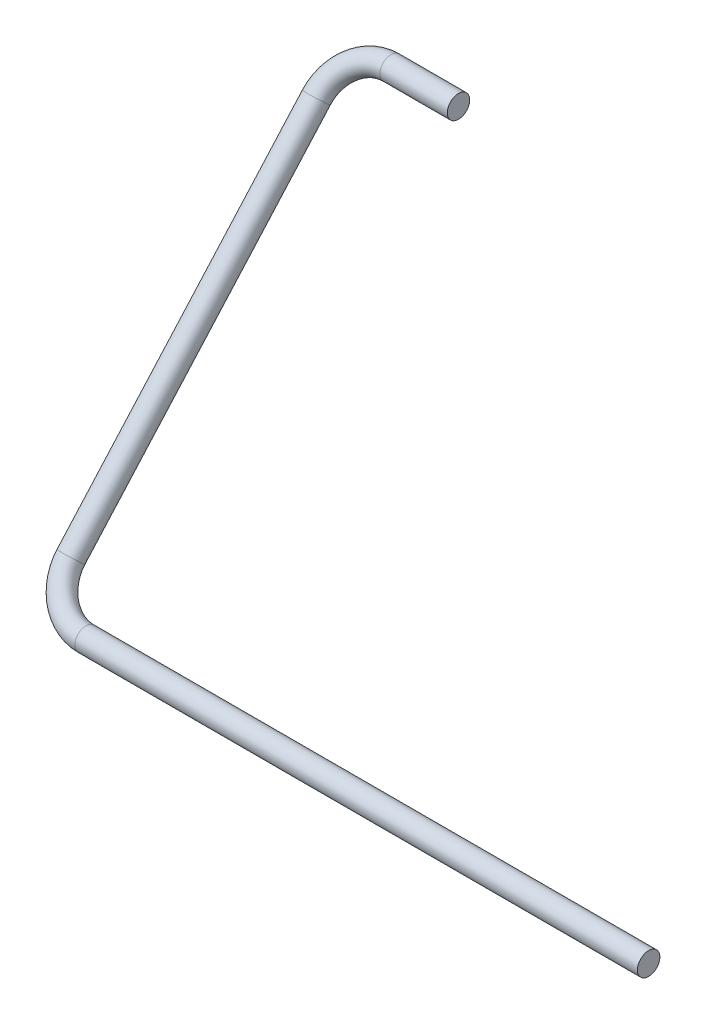
ISO-10303-21;
HEADER;
FILE_DESCRIPTION(('STEP AP214'),'2;1');
FILE_NAME('part.step','',(''),(''),'','','');
FILE_SCHEMA(('AUTOMOTIVE_DESIGN { 1 0 10303 214 1 1 1 1 }'));
ENDSEC;
DATA;
#1=APPLICATION_CONTEXT('core data for automotive mechanical design processes');
#2=APPLICATION_PROTOCOL_DEFINITION('international standard','automotive_design',2000,#1);
#3=PRODUCT_CONTEXT('',#1,'mechanical');
#4=PRODUCT('Part','Part','',(#3));
#5=PRODUCT_RELATED_PRODUCT_CATEGORY('part','',(#4));
#6=PRODUCT_DEFINITION_FORMATION('','',#4);
#7=PRODUCT_DEFINITION_CONTEXT('part definition',#1,'design');
#8=PRODUCT_DEFINITION('design','',#6,#7);
#9=PRODUCT_DEFINITION_SHAPE('','',#8);
#10=(LENGTH_UNIT() NAMED_UNIT(*) SI_UNIT(.MILLI.,.METRE.));
#11=(NAMED_UNIT(*) PLANE_ANGLE_UNIT() SI_UNIT($,.RADIAN.));
#12=(NAMED_UNIT(*) SI_UNIT($,.STERADIAN.) SOLID_ANGLE_UNIT());
#13=UNCERTAINTY_MEASURE_WITH_UNIT(LENGTH_MEASURE(1.E-05),#10,'distance_accuracy_value','');
#14=(GEOMETRIC_REPRESENTATION_CONTEXT(3) GLOBAL_UNCERTAINTY_ASSIGNED_CONTEXT((#13)) GLOBAL_UNIT_ASSIGNED_CONTEXT((#10,
#11,#12)) REPRESENTATION_CONTEXT('',''));
#15=CARTESIAN_POINT('',(0.,0.,0.));
#16=DIRECTION('',(0.,0.,1.));
#17=DIRECTION('',(1.,0.,0.));
#18=AXIS2_PLACEMENT_3D('',#15,#16,#17);
#19=CARTESIAN_POINT('',(-354.878454363053,1611.503,66.2784042889684));
#20=DIRECTION('',(-1.,0.,0.));
#21=DIRECTION('',(0.,0.,1.));
#22=AXIS2_PLACEMENT_3D('',#19,#20,#21);
#23=PLANE('',#22);
#24=CARTESIAN_POINT('',(-354.878454363053,1611.503,66.2784042889684));
#25=DIRECTION('',(-1.,0.,0.));
#26=DIRECTION('',(0.,0.,1.));
#27=AXIS2_PLACEMENT_3D('',#24,#25,#26);
#28=CIRCLE('',#27,6.34999999999999);
#29=CARTESIAN_POINT('',(-354.878454363053,1611.503,72.6284042889684));
#30=VERTEX_POINT('',#29);
#31=EDGE_CURVE('E79',#30,#30,#28,.T.);
#32=ORIENTED_EDGE('',*,*,#31,.F.);
#33=EDGE_LOOP('',(#32));
#34=FACE_BOUND('',#33,.T.);
#35=ADVANCED_FACE('F57',(#34),#23,.F.);
#36=CARTESIAN_POINT('',(-635.040454363053,1805.03259931892,-106.30682117625));
#37=DIRECTION('',(1.,0.,0.));
#38=DIRECTION('',(0.,0.993476042040195,0.114041018463306));
#39=AXIS2_PLACEMENT_3D('',#36,#37,#38);
#40=PLANE('',#39);
#41=CARTESIAN_POINT('',(-635.040454363053,1805.03259931892,-106.30682117625));
#42=DIRECTION('',(1.,0.,0.));
#43=DIRECTION('',(0.,0.993476042040195,0.114041018463306));
#44=AXIS2_PLACEMENT_3D('',#41,#42,#43);
#45=CIRCLE('',#44,6.34999999999999);
#46=CARTESIAN_POINT('',(-635.040454363053,1811.34117218588,-105.582660709008));
#47=VERTEX_POINT('',#46);
#48=EDGE_CURVE('E13',#47,#47,#45,.T.);
#49=ORIENTED_EDGE('',*,*,#48,.T.);
#50=EDGE_LOOP('',(#49));
#51=FACE_BOUND('',#50,.T.);
#52=ADVANCED_FACE('F86',(#51),#40,.T.);
#53=CARTESIAN_POINT('',(-354.878454363053,1611.503,66.2784042889684));
#54=DIRECTION('',(-1.,0.,0.));
#55=DIRECTION('',(0.,0.,1.));
#56=AXIS2_PLACEMENT_3D('',#53,#54,#55);
#57=CYLINDRICAL_SURFACE('',#56,6.34999999999999);
#58=CARTESIAN_POINT('',(-673.140454363053,1611.503,66.2784042889682));
#59=DIRECTION('',(-1.,0.,0.));
#60=DIRECTION('',(0.,0.,1.));
#61=AXIS2_PLACEMENT_3D('',#58,#59,#60);
#62=CIRCLE('',#61,6.34999999999999);
#63=CARTESIAN_POINT('',(-673.140454363053,1606.76375327889,70.5047550217525));
#64=VERTEX_POINT('',#63);
#65=EDGE_CURVE('E76',#64,#64,#62,.T.);
#66=ORIENTED_EDGE('',*,*,#65,.F.);
#67=EDGE_LOOP('',(#66));
#68=FACE_BOUND('',#67,.T.);
#69=ORIENTED_EDGE('',*,*,#31,.T.);
#70=EDGE_LOOP('',(#69));
#71=FACE_BOUND('',#70,.T.);
#72=ADVANCED_FACE('F83',(#68,#71),#57,.T.);
#73=CARTESIAN_POINT('',(-673.140454363053,1630.45998688441,49.373001357831));
#74=DIRECTION('',(0.,-0.665567044532966,-0.746338066315562));
#75=DIRECTION('',(0.,0.746338066315562,-0.665567044532966));
#76=AXIS2_PLACEMENT_3D('',#73,#74,#75);
#77=TOROIDAL_SURFACE('',#76,25.3999999999999,6.34999999999999);
#78=CARTESIAN_POINT('',(-698.540454363053,1630.45998688441,49.3730013578312));
#79=DIRECTION('',(0.,0.746338066315562,-0.665567044532966));
#80=DIRECTION('',(-0.665567044532966,0.496738021020098,0.557020509231652));
#81=AXIS2_PLACEMENT_3D('',#78,#79,#80);
#82=CIRCLE('',#81,6.34999999999999);
#83=CARTESIAN_POINT('',(-704.890454363053,1630.45998688441,49.3730013578312));
#84=VERTEX_POINT('',#83);
#85=EDGE_CURVE('E71',#84,#84,#82,.T.);
#86=CARTESIAN_POINT('',(-673.140454363053,1630.45998688441,49.373001357831));
#87=DIRECTION('',(0.,-0.665567044532966,-0.746338066315562));
#88=DIRECTION('',(0.,0.746338066315562,-0.665567044532966));
#89=AXIS2_PLACEMENT_3D('',#86,#87,#88);
#90=CIRCLE('',#89,31.7499999999999);
#91=EDGE_CURVE('',#64,#84,#90,.T.);
#92=ORIENTED_EDGE('',*,*,#65,.T.);
#93=ORIENTED_EDGE('',*,*,#85,.F.);
#94=ORIENTED_EDGE('',*,*,#91,.T.);
#95=ORIENTED_EDGE('',*,*,#91,.F.);
#96=EDGE_LOOP('',(#92,#94,#93,#95));
#97=FACE_BOUND('',#96,.T.);
#98=ADVANCED_FACE('F104',(#97),#77,.T.);
#99=CARTESIAN_POINT('',(-698.540454363053,1630.45998688441,49.373001357831));
#100=DIRECTION('',(0.,0.746338066315562,-0.665567044532967));
#101=DIRECTION('',(0.,0.665567044532967,0.746338066315562));
#102=AXIS2_PLACEMENT_3D('',#99,#100,#101);
#103=CYLINDRICAL_SURFACE('',#102,6.34999999999999);
#104=CARTESIAN_POINT('',(-698.540454363053,1786.07561243451,-89.4014182451122));
#105=DIRECTION('',(0.,0.746338066315561,-0.665567044532967));
#106=DIRECTION('',(-0.665567044532966,0.496738021020098,0.557020509231652));
#107=AXIS2_PLACEMENT_3D('',#104,#105,#106);
#108=CIRCLE('',#107,6.34999999999999);
#109=CARTESIAN_POINT('',(-704.890454363053,1786.07561243451,-89.4014182451122));
#110=VERTEX_POINT('',#109);
#111=EDGE_CURVE('E67',#110,#110,#108,.T.);
#112=ORIENTED_EDGE('',*,*,#111,.F.);
#113=EDGE_LOOP('',(#112));
#114=FACE_BOUND('',#113,.T.);
#115=ORIENTED_EDGE('',*,*,#85,.T.);
#116=EDGE_LOOP('',(#115));
#117=FACE_BOUND('',#116,.T.);
#118=ADVANCED_FACE('F98',(#114,#117),#103,.T.);
#119=CARTESIAN_POINT('',(-673.140454363053,1786.07561243451,-89.4014182451122));
#120=DIRECTION('',(0.,-0.665567044532966,-0.746338066315563));
#121=DIRECTION('',(0.,0.746338066315563,-0.665567044532966));
#122=AXIS2_PLACEMENT_3D('',#119,#120,#121);
#123=TOROIDAL_SURFACE('',#122,25.4000000000001,6.34999999999999);
#124=CARTESIAN_POINT('',(-673.140454363053,1805.03259931892,-106.30682117625));
#125=DIRECTION('',(1.,0.,0.));
#126=DIRECTION('',(0.,0.993476042040195,0.114041018463306));
#127=AXIS2_PLACEMENT_3D('',#124,#125,#126);
#128=CIRCLE('',#127,6.34999999999999);
#129=CARTESIAN_POINT('',(-673.140454363053,1809.77184604003,-110.533171909034));
#130=VERTEX_POINT('',#129);
#131=EDGE_CURVE('E63',#130,#130,#128,.T.);
#132=CARTESIAN_POINT('',(-673.140454363053,1786.07561243451,-89.4014182451122));
#133=DIRECTION('',(0.,-0.665567044532966,-0.746338066315563));
#134=DIRECTION('',(0.,0.746338066315563,-0.665567044532966));
#135=AXIS2_PLACEMENT_3D('',#132,#133,#134);
#136=CIRCLE('',#135,31.7500000000001);
#137=EDGE_CURVE('',#110,#130,#136,.T.);
#138=ORIENTED_EDGE('',*,*,#111,.T.);
#139=ORIENTED_EDGE('',*,*,#131,.F.);
#140=ORIENTED_EDGE('',*,*,#137,.T.);
#141=ORIENTED_EDGE('',*,*,#137,.F.);
#142=EDGE_LOOP('',(#138,#140,#139,#141));
#143=FACE_BOUND('',#142,.T.);
#144=ADVANCED_FACE('F92',(#143),#123,.T.);
#145=CARTESIAN_POINT('',(-673.140454363053,1805.03259931892,-106.30682117625));
#146=DIRECTION('',(1.,0.,0.));
#147=DIRECTION('',(0.,0.,-1.));
#148=AXIS2_PLACEMENT_3D('',#145,#146,#147);
#149=CYLINDRICAL_SURFACE('',#148,6.34999999999999);
#150=ORIENTED_EDGE('',*,*,#48,.F.);
#151=EDGE_LOOP('',(#150));
#152=FACE_BOUND('',#151,.T.);
#153=ORIENTED_EDGE('',*,*,#131,.T.);
#154=EDGE_LOOP('',(#153));
#155=FACE_BOUND('',#154,.T.);
#156=ADVANCED_FACE('F90',(#152,#155),#149,.T.);
#157=CLOSED_SHELL('',(#35,#52,#72,#98,#118,#144,#156));
#158=MANIFOLD_SOLID_BREP('B2',#157);
#159=ADVANCED_BREP_SHAPE_REPRESENTATION('',(#18,#158),#14);
#160=SHAPE_DEFINITION_REPRESENTATION(#9,#159);
ENDSEC;
END-ISO-10303-21;
